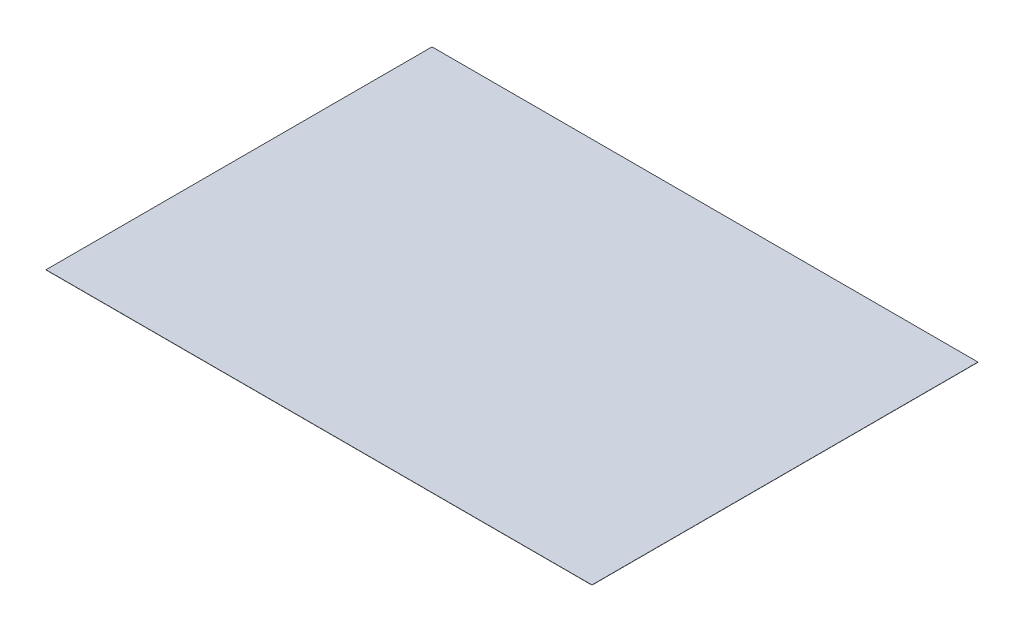
ISO-10303-21;
HEADER;
FILE_DESCRIPTION(('STEP AP214'),'2;1');
FILE_NAME('part.step','',(''),(''),'','','');
FILE_SCHEMA(('AUTOMOTIVE_DESIGN { 1 0 10303 214 1 1 1 1 }'));
ENDSEC;
DATA;
#1=APPLICATION_CONTEXT('core data for automotive mechanical design processes');
#2=APPLICATION_PROTOCOL_DEFINITION('international standard','automotive_design',2000,#1);
#3=PRODUCT_CONTEXT('',#1,'mechanical');
#4=PRODUCT('Part','Part','',(#3));
#5=PRODUCT_RELATED_PRODUCT_CATEGORY('part','',(#4));
#6=PRODUCT_DEFINITION_FORMATION('','',#4);
#7=PRODUCT_DEFINITION_CONTEXT('part definition',#1,'design');
#8=PRODUCT_DEFINITION('design','',#6,#7);
#9=PRODUCT_DEFINITION_SHAPE('','',#8);
#10=(LENGTH_UNIT() NAMED_UNIT(*) SI_UNIT(.MILLI.,.METRE.));
#11=(NAMED_UNIT(*) PLANE_ANGLE_UNIT() SI_UNIT($,.RADIAN.));
#12=(NAMED_UNIT(*) SI_UNIT($,.STERADIAN.) SOLID_ANGLE_UNIT());
#13=UNCERTAINTY_MEASURE_WITH_UNIT(LENGTH_MEASURE(1.E-05),#10,'distance_accuracy_value','');
#14=(GEOMETRIC_REPRESENTATION_CONTEXT(3) GLOBAL_UNCERTAINTY_ASSIGNED_CONTEXT((#13)) GLOBAL_UNIT_ASSIGNED_CONTEXT((#10,
#11,#12)) REPRESENTATION_CONTEXT('',''));
#15=CARTESIAN_POINT('',(0.,0.,0.));
#16=DIRECTION('',(0.,0.,1.));
#17=DIRECTION('',(1.,0.,0.));
#18=AXIS2_PLACEMENT_3D('',#15,#16,#17);
#19=CARTESIAN_POINT('',(0.,0.1,0.));
#20=DIRECTION('',(1.,0.,0.));
#21=DIRECTION('',(0.,0.,-1.));
#22=AXIS2_PLACEMENT_3D('',#19,#20,#21);
#23=PLANE('',#22);
#24=DIRECTION('',(0.,0.,1.));
#25=VECTOR('',#24,1.);
#26=CARTESIAN_POINT('',(0.,0.,0.));
#27=LINE('',#26,#25);
#28=CARTESIAN_POINT('',(0.,0.,-210.));
#29=VERTEX_POINT('',#28);
#30=CARTESIAN_POINT('',(0.,0.,0.));
#31=VERTEX_POINT('',#30);
#32=EDGE_CURVE('E107',#29,#31,#27,.T.);
#33=ORIENTED_EDGE('',*,*,#32,.T.);
#34=DIRECTION('',(0.,-1.,0.));
#35=VECTOR('',#34,1.);
#36=CARTESIAN_POINT('',(0.,0.1,0.));
#37=LINE('',#36,#35);
#38=CARTESIAN_POINT('',(0.,0.1,0.));
#39=VERTEX_POINT('',#38);
#40=EDGE_CURVE('E11',#39,#31,#37,.T.);
#41=ORIENTED_EDGE('',*,*,#40,.F.);
#42=DIRECTION('',(0.,0.,1.));
#43=VECTOR('',#42,1.);
#44=CARTESIAN_POINT('',(0.,0.1,0.));
#45=LINE('',#44,#43);
#46=CARTESIAN_POINT('',(0.,0.1,-210.));
#47=VERTEX_POINT('',#46);
#48=EDGE_CURVE('E91',#47,#39,#45,.T.);
#49=ORIENTED_EDGE('',*,*,#48,.F.);
#50=DIRECTION('',(0.,-1.,0.));
#51=VECTOR('',#50,1.);
#52=CARTESIAN_POINT('',(0.,0.1,-210.));
#53=LINE('',#52,#51);
#54=EDGE_CURVE('E103',#47,#29,#53,.T.);
#55=ORIENTED_EDGE('',*,*,#54,.T.);
#56=EDGE_LOOP('',(#33,#41,#49,#55));
#57=FACE_BOUND('',#56,.T.);
#58=ADVANCED_FACE('F39',(#57),#23,.F.);
#59=CARTESIAN_POINT('',(0.,0.1,0.));
#60=DIRECTION('',(0.,0.,-1.));
#61=DIRECTION('',(-1.,0.,0.));
#62=AXIS2_PLACEMENT_3D('',#59,#60,#61);
#63=PLANE('',#62);
#64=DIRECTION('',(1.,0.,0.));
#65=VECTOR('',#64,1.);
#66=CARTESIAN_POINT('',(0.,0.,0.));
#67=LINE('',#66,#65);
#68=CARTESIAN_POINT('',(297.,0.,0.));
#69=VERTEX_POINT('',#68);
#70=EDGE_CURVE('E96',#31,#69,#67,.T.);
#71=ORIENTED_EDGE('',*,*,#70,.T.);
#72=DIRECTION('',(0.,-1.,0.));
#73=VECTOR('',#72,1.);
#74=CARTESIAN_POINT('',(297.,0.1,0.));
#75=LINE('',#74,#73);
#76=CARTESIAN_POINT('',(297.,0.1,0.));
#77=VERTEX_POINT('',#76);
#78=EDGE_CURVE('E48',#77,#69,#75,.T.);
#79=ORIENTED_EDGE('',*,*,#78,.F.);
#80=DIRECTION('',(1.,0.,0.));
#81=VECTOR('',#80,1.);
#82=CARTESIAN_POINT('',(0.,0.1,0.));
#83=LINE('',#82,#81);
#84=EDGE_CURVE('E86',#39,#77,#83,.T.);
#85=ORIENTED_EDGE('',*,*,#84,.F.);
#86=ORIENTED_EDGE('',*,*,#40,.T.);
#87=EDGE_LOOP('',(#71,#79,#85,#86));
#88=FACE_BOUND('',#87,.T.);
#89=ADVANCED_FACE('F95',(#88),#63,.F.);
#90=CARTESIAN_POINT('',(297.,0.1,0.));
#91=DIRECTION('',(-1.,0.,0.));
#92=DIRECTION('',(0.,0.,1.));
#93=AXIS2_PLACEMENT_3D('',#90,#91,#92);
#94=PLANE('',#93);
#95=DIRECTION('',(0.,0.,-1.));
#96=VECTOR('',#95,1.);
#97=CARTESIAN_POINT('',(297.,0.,0.));
#98=LINE('',#97,#96);
#99=CARTESIAN_POINT('',(297.,0.,-210.));
#100=VERTEX_POINT('',#99);
#101=EDGE_CURVE('E73',#69,#100,#98,.T.);
#102=ORIENTED_EDGE('',*,*,#101,.T.);
#103=DIRECTION('',(0.,-1.,0.));
#104=VECTOR('',#103,1.);
#105=CARTESIAN_POINT('',(297.,0.1,-210.));
#106=LINE('',#105,#104);
#107=CARTESIAN_POINT('',(297.,0.1,-210.));
#108=VERTEX_POINT('',#107);
#109=EDGE_CURVE('E98',#108,#100,#106,.T.);
#110=ORIENTED_EDGE('',*,*,#109,.F.);
#111=DIRECTION('',(0.,0.,-1.));
#112=VECTOR('',#111,1.);
#113=CARTESIAN_POINT('',(297.,0.1,0.));
#114=LINE('',#113,#112);
#115=EDGE_CURVE('E89',#77,#108,#114,.T.);
#116=ORIENTED_EDGE('',*,*,#115,.F.);
#117=ORIENTED_EDGE('',*,*,#78,.T.);
#118=EDGE_LOOP('',(#102,#110,#116,#117));
#119=FACE_BOUND('',#118,.T.);
#120=ADVANCED_FACE('F99',(#119),#94,.F.);
#121=CARTESIAN_POINT('',(0.,0.1,-210.));
#122=DIRECTION('',(0.,0.,1.));
#123=DIRECTION('',(1.,0.,0.));
#124=AXIS2_PLACEMENT_3D('',#121,#122,#123);
#125=PLANE('',#124);
#126=DIRECTION('',(-1.,0.,0.));
#127=VECTOR('',#126,1.);
#128=CARTESIAN_POINT('',(0.,0.,-210.));
#129=LINE('',#128,#127);
#130=EDGE_CURVE('E79',#100,#29,#129,.T.);
#131=ORIENTED_EDGE('',*,*,#130,.T.);
#132=ORIENTED_EDGE('',*,*,#54,.F.);
#133=DIRECTION('',(-1.,0.,0.));
#134=VECTOR('',#133,1.);
#135=CARTESIAN_POINT('',(0.,0.1,-210.));
#136=LINE('',#135,#134);
#137=EDGE_CURVE('E56',#108,#47,#136,.T.);
#138=ORIENTED_EDGE('',*,*,#137,.F.);
#139=ORIENTED_EDGE('',*,*,#109,.T.);
#140=EDGE_LOOP('',(#131,#132,#138,#139));
#141=FACE_BOUND('',#140,.T.);
#142=ADVANCED_FACE('F120',(#141),#125,.F.);
#143=CARTESIAN_POINT('',(0.,0.1,0.));
#144=DIRECTION('',(0.,-1.,0.));
#145=DIRECTION('',(0.,0.,-1.));
#146=AXIS2_PLACEMENT_3D('',#143,#144,#145);
#147=PLANE('',#146);
#148=ORIENTED_EDGE('',*,*,#48,.T.);
#149=ORIENTED_EDGE('',*,*,#84,.T.);
#150=ORIENTED_EDGE('',*,*,#115,.T.);
#151=ORIENTED_EDGE('',*,*,#137,.T.);
#152=EDGE_LOOP('',(#148,#149,#150,#151));
#153=FACE_BOUND('',#152,.T.);
#154=ADVANCED_FACE('F87',(#153),#147,.F.);
#155=CARTESIAN_POINT('',(0.,0.,0.));
#156=DIRECTION('',(0.,-1.,0.));
#157=DIRECTION('',(0.,0.,-1.));
#158=AXIS2_PLACEMENT_3D('',#155,#156,#157);
#159=PLANE('',#158);
#160=ORIENTED_EDGE('',*,*,#32,.F.);
#161=ORIENTED_EDGE('',*,*,#130,.F.);
#162=ORIENTED_EDGE('',*,*,#101,.F.);
#163=ORIENTED_EDGE('',*,*,#70,.F.);
#164=EDGE_LOOP('',(#160,#161,#162,#163));
#165=FACE_BOUND('',#164,.T.);
#166=ADVANCED_FACE('F123',(#165),#159,.T.);
#167=CLOSED_SHELL('',(#58,#89,#120,#142,#154,#166));
#168=MANIFOLD_SOLID_BREP('B2',#167);
#169=ADVANCED_BREP_SHAPE_REPRESENTATION('',(#18,#168),#14);
#170=SHAPE_DEFINITION_REPRESENTATION(#9,#169);
ENDSEC;
END-ISO-10303-21;
